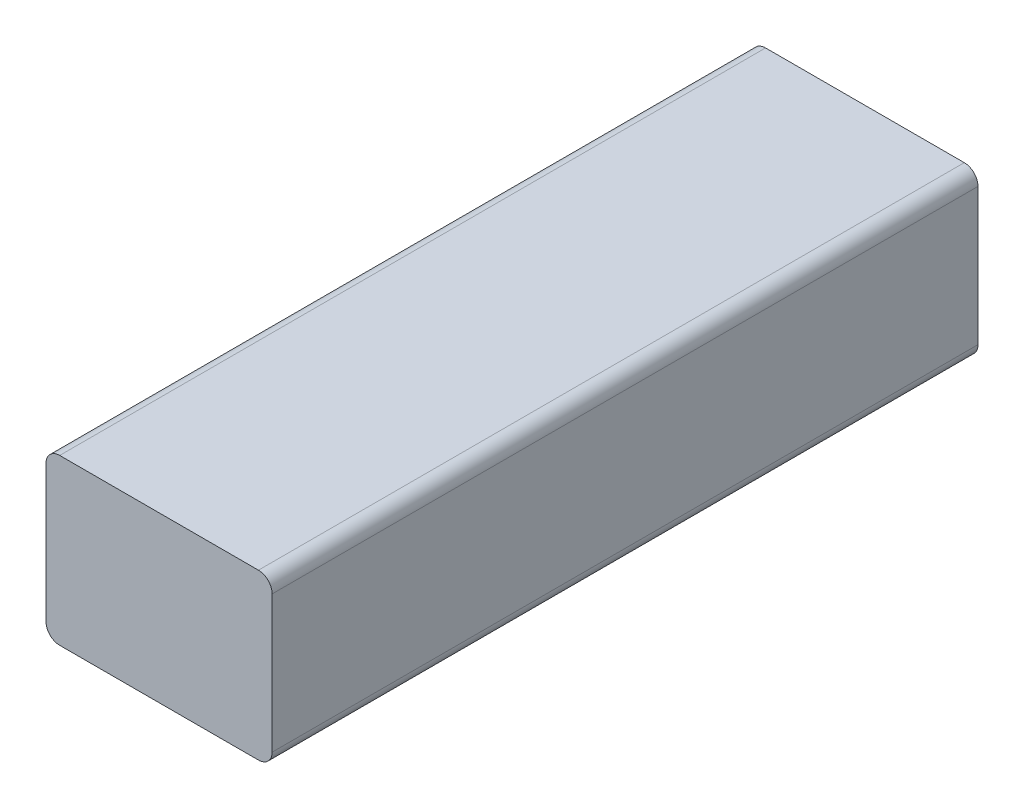
ISO-10303-21;
HEADER;
FILE_DESCRIPTION(('STEP AP214'),'2;1');
FILE_NAME('part.step','',(''),(''),'','','');
FILE_SCHEMA(('AUTOMOTIVE_DESIGN { 1 0 10303 214 1 1 1 1 }'));
ENDSEC;
DATA;
#1=APPLICATION_CONTEXT('core data for automotive mechanical design processes');
#2=APPLICATION_PROTOCOL_DEFINITION('international standard','automotive_design',2000,#1);
#3=PRODUCT_CONTEXT('',#1,'mechanical');
#4=PRODUCT('Part','Part','',(#3));
#5=PRODUCT_RELATED_PRODUCT_CATEGORY('part','',(#4));
#6=PRODUCT_DEFINITION_FORMATION('','',#4);
#7=PRODUCT_DEFINITION_CONTEXT('part definition',#1,'design');
#8=PRODUCT_DEFINITION('design','',#6,#7);
#9=PRODUCT_DEFINITION_SHAPE('','',#8);
#10=(LENGTH_UNIT() NAMED_UNIT(*) SI_UNIT(.MILLI.,.METRE.));
#11=(NAMED_UNIT(*) PLANE_ANGLE_UNIT() SI_UNIT($,.RADIAN.));
#12=(NAMED_UNIT(*) SI_UNIT($,.STERADIAN.) SOLID_ANGLE_UNIT());
#13=UNCERTAINTY_MEASURE_WITH_UNIT(LENGTH_MEASURE(1.E-05),#10,'distance_accuracy_value','');
#14=(GEOMETRIC_REPRESENTATION_CONTEXT(3) GLOBAL_UNCERTAINTY_ASSIGNED_CONTEXT((#13)) GLOBAL_UNIT_ASSIGNED_CONTEXT((#10,
#11,#12)) REPRESENTATION_CONTEXT('',''));
#15=CARTESIAN_POINT('',(0.,0.,0.));
#16=DIRECTION('',(0.,0.,1.));
#17=DIRECTION('',(1.,0.,0.));
#18=AXIS2_PLACEMENT_3D('',#15,#16,#17);
#19=CARTESIAN_POINT('',(-14.5,22.,-51.5));
#20=DIRECTION('',(0.,0.,1.));
#21=DIRECTION('',(1.,0.,0.));
#22=AXIS2_PLACEMENT_3D('',#19,#20,#21);
#23=CYLINDRICAL_SURFACE('',#22,2.);
#24=DIRECTION('',(0.,0.,1.));
#25=VECTOR('',#24,1.);
#26=CARTESIAN_POINT('',(-16.5,22.,0.));
#27=LINE('',#26,#25);
#28=CARTESIAN_POINT('',(-16.5,22.,-51.5));
#29=VERTEX_POINT('',#28);
#30=CARTESIAN_POINT('',(-16.5,22.,51.5));
#31=VERTEX_POINT('',#30);
#32=EDGE_CURVE('E117',#29,#31,#27,.T.);
#33=ORIENTED_EDGE('',*,*,#32,.T.);
#34=CARTESIAN_POINT('',(-14.5,22.,51.5));
#35=DIRECTION('',(0.,0.,1.));
#36=DIRECTION('',(1.,0.,0.));
#37=AXIS2_PLACEMENT_3D('',#34,#35,#36);
#38=CIRCLE('',#37,2.);
#39=CARTESIAN_POINT('',(-14.5,24.,51.5));
#40=VERTEX_POINT('',#39);
#41=EDGE_CURVE('E125',#31,#40,#38,.F.);
#42=ORIENTED_EDGE('',*,*,#41,.T.);
#43=DIRECTION('',(0.,0.,-1.));
#44=VECTOR('',#43,1.);
#45=CARTESIAN_POINT('',(-14.5,24.,0.));
#46=LINE('',#45,#44);
#47=CARTESIAN_POINT('',(-14.5,24.,-51.5));
#48=VERTEX_POINT('',#47);
#49=EDGE_CURVE('E122',#40,#48,#46,.T.);
#50=ORIENTED_EDGE('',*,*,#49,.T.);
#51=CARTESIAN_POINT('',(-14.5,22.,-51.5));
#52=DIRECTION('',(0.,0.,1.));
#53=DIRECTION('',(1.,0.,0.));
#54=AXIS2_PLACEMENT_3D('',#51,#52,#53);
#55=CIRCLE('',#54,2.);
#56=EDGE_CURVE('E113',#48,#29,#55,.T.);
#57=ORIENTED_EDGE('',*,*,#56,.T.);
#58=EDGE_LOOP('',(#33,#42,#50,#57));
#59=FACE_BOUND('',#58,.T.);
#60=ADVANCED_FACE('F17',(#59),#23,.T.);
#61=CARTESIAN_POINT('',(-14.5,24.,51.5));
#62=DIRECTION('',(0.,-1.,0.));
#63=DIRECTION('',(0.,0.,-1.));
#64=AXIS2_PLACEMENT_3D('',#61,#62,#63);
#65=PLANE('',#64);
#66=ORIENTED_EDGE('',*,*,#49,.F.);
#67=DIRECTION('',(1.,0.,0.));
#68=VECTOR('',#67,1.);
#69=CARTESIAN_POINT('',(0.,24.,51.5));
#70=LINE('',#69,#68);
#71=CARTESIAN_POINT('',(14.5000000002051,24.,51.5));
#72=VERTEX_POINT('',#71);
#73=EDGE_CURVE('E134',#40,#72,#70,.T.);
#74=ORIENTED_EDGE('',*,*,#73,.T.);
#75=DIRECTION('',(0.,0.,1.));
#76=VECTOR('',#75,1.);
#77=CARTESIAN_POINT('',(14.5000000004102,24.,0.));
#78=LINE('',#77,#76);
#79=CARTESIAN_POINT('',(14.5000000002051,24.,-51.5));
#80=VERTEX_POINT('',#79);
#81=EDGE_CURVE('E89',#72,#80,#78,.F.);
#82=ORIENTED_EDGE('',*,*,#81,.T.);
#83=DIRECTION('',(-1.,0.,0.));
#84=VECTOR('',#83,1.);
#85=CARTESIAN_POINT('',(0.,24.,-51.5));
#86=LINE('',#85,#84);
#87=EDGE_CURVE('E86',#80,#48,#86,.T.);
#88=ORIENTED_EDGE('',*,*,#87,.T.);
#89=EDGE_LOOP('',(#66,#74,#82,#88));
#90=FACE_BOUND('',#89,.T.);
#91=ADVANCED_FACE('F143',(#90),#65,.F.);
#92=CARTESIAN_POINT('',(-14.5,0.,51.5));
#93=DIRECTION('',(0.,-1.,0.));
#94=DIRECTION('',(0.,0.,-1.));
#95=AXIS2_PLACEMENT_3D('',#92,#93,#94);
#96=PLANE('',#95);
#97=DIRECTION('',(1.,0.,0.));
#98=VECTOR('',#97,1.);
#99=CARTESIAN_POINT('',(0.,0.,-51.5));
#100=LINE('',#99,#98);
#101=CARTESIAN_POINT('',(-14.4999999996153,0.,-51.5));
#102=VERTEX_POINT('',#101);
#103=CARTESIAN_POINT('',(14.4999999996153,0.,-51.5));
#104=VERTEX_POINT('',#103);
#105=EDGE_CURVE('E106',#102,#104,#100,.T.);
#106=ORIENTED_EDGE('',*,*,#105,.T.);
#107=DIRECTION('',(0.,0.,-1.));
#108=VECTOR('',#107,1.);
#109=CARTESIAN_POINT('',(14.4999999992306,0.,0.));
#110=LINE('',#109,#108);
#111=CARTESIAN_POINT('',(14.4999999996153,0.,51.5));
#112=VERTEX_POINT('',#111);
#113=EDGE_CURVE('E123',#104,#112,#110,.F.);
#114=ORIENTED_EDGE('',*,*,#113,.T.);
#115=DIRECTION('',(-1.,0.,0.));
#116=VECTOR('',#115,1.);
#117=CARTESIAN_POINT('',(0.,0.,51.5));
#118=LINE('',#117,#116);
#119=CARTESIAN_POINT('',(-14.4999999996153,0.,51.5));
#120=VERTEX_POINT('',#119);
#121=EDGE_CURVE('E131',#112,#120,#118,.T.);
#122=ORIENTED_EDGE('',*,*,#121,.T.);
#123=DIRECTION('',(0.,0.,1.));
#124=VECTOR('',#123,1.);
#125=CARTESIAN_POINT('',(-14.4999999992306,0.,0.));
#126=LINE('',#125,#124);
#127=EDGE_CURVE('E120',#120,#102,#126,.F.);
#128=ORIENTED_EDGE('',*,*,#127,.T.);
#129=EDGE_LOOP('',(#106,#114,#122,#128));
#130=FACE_BOUND('',#129,.T.);
#131=ADVANCED_FACE('F155',(#130),#96,.T.);
#132=CARTESIAN_POINT('',(-14.5,2.,51.5));
#133=DIRECTION('',(0.,0.,-1.));
#134=DIRECTION('',(-1.,0.,0.));
#135=AXIS2_PLACEMENT_3D('',#132,#133,#134);
#136=CYLINDRICAL_SURFACE('',#135,2.);
#137=ORIENTED_EDGE('',*,*,#127,.F.);
#138=CARTESIAN_POINT('',(-14.5,2.,51.5));
#139=DIRECTION('',(0.,0.,-1.));
#140=DIRECTION('',(-1.,0.,0.));
#141=AXIS2_PLACEMENT_3D('',#138,#139,#140);
#142=CIRCLE('',#141,2.);
#143=CARTESIAN_POINT('',(-16.5,2.,51.5));
#144=VERTEX_POINT('',#143);
#145=EDGE_CURVE('E102',#120,#144,#142,.T.);
#146=ORIENTED_EDGE('',*,*,#145,.T.);
#147=DIRECTION('',(0.,0.,-1.));
#148=VECTOR('',#147,1.);
#149=CARTESIAN_POINT('',(-16.5,2.,0.));
#150=LINE('',#149,#148);
#151=CARTESIAN_POINT('',(-16.5,2.,-51.5));
#152=VERTEX_POINT('',#151);
#153=EDGE_CURVE('E115',#144,#152,#150,.T.);
#154=ORIENTED_EDGE('',*,*,#153,.T.);
#155=CARTESIAN_POINT('',(-14.5,2.,-51.5));
#156=DIRECTION('',(0.,0.,-1.));
#157=DIRECTION('',(-1.,0.,0.));
#158=AXIS2_PLACEMENT_3D('',#155,#156,#157);
#159=CIRCLE('',#158,2.);
#160=EDGE_CURVE('E109',#152,#102,#159,.F.);
#161=ORIENTED_EDGE('',*,*,#160,.T.);
#162=EDGE_LOOP('',(#137,#146,#154,#161));
#163=FACE_BOUND('',#162,.T.);
#164=ADVANCED_FACE('F160',(#163),#136,.T.);
#165=CARTESIAN_POINT('',(-16.5,2.,51.5));
#166=DIRECTION('',(1.,0.,0.));
#167=DIRECTION('',(0.,0.,-1.));
#168=AXIS2_PLACEMENT_3D('',#165,#166,#167);
#169=PLANE('',#168);
#170=ORIENTED_EDGE('',*,*,#153,.F.);
#171=DIRECTION('',(0.,1.,0.));
#172=VECTOR('',#171,1.);
#173=CARTESIAN_POINT('',(-16.5,12.,51.5));
#174=LINE('',#173,#172);
#175=EDGE_CURVE('E99',#144,#31,#174,.T.);
#176=ORIENTED_EDGE('',*,*,#175,.T.);
#177=ORIENTED_EDGE('',*,*,#32,.F.);
#178=DIRECTION('',(0.,-1.,0.));
#179=VECTOR('',#178,1.);
#180=CARTESIAN_POINT('',(-16.5,12.,-51.5));
#181=LINE('',#180,#179);
#182=EDGE_CURVE('E110',#29,#152,#181,.T.);
#183=ORIENTED_EDGE('',*,*,#182,.T.);
#184=EDGE_LOOP('',(#170,#176,#177,#183));
#185=FACE_BOUND('',#184,.T.);
#186=ADVANCED_FACE('F163',(#185),#169,.F.);
#187=CARTESIAN_POINT('',(14.5,22.,51.5));
#188=DIRECTION('',(0.,0.,-1.));
#189=DIRECTION('',(-1.,0.,0.));
#190=AXIS2_PLACEMENT_3D('',#187,#188,#189);
#191=CYLINDRICAL_SURFACE('',#190,2.);
#192=DIRECTION('',(0.,0.,-1.));
#193=VECTOR('',#192,1.);
#194=CARTESIAN_POINT('',(16.5,22.,0.));
#195=LINE('',#194,#193);
#196=CARTESIAN_POINT('',(16.5,22.,51.5));
#197=VERTEX_POINT('',#196);
#198=CARTESIAN_POINT('',(16.5,22.,-51.5));
#199=VERTEX_POINT('',#198);
#200=EDGE_CURVE('E92',#197,#199,#195,.T.);
#201=ORIENTED_EDGE('',*,*,#200,.T.);
#202=CARTESIAN_POINT('',(14.5,22.,-51.5));
#203=DIRECTION('',(0.,0.,-1.));
#204=DIRECTION('',(-1.,0.,0.));
#205=AXIS2_PLACEMENT_3D('',#202,#203,#204);
#206=CIRCLE('',#205,2.);
#207=EDGE_CURVE('E21',#199,#80,#206,.F.);
#208=ORIENTED_EDGE('',*,*,#207,.T.);
#209=ORIENTED_EDGE('',*,*,#81,.F.);
#210=CARTESIAN_POINT('',(14.5,22.,51.5));
#211=DIRECTION('',(0.,0.,-1.));
#212=DIRECTION('',(-1.,0.,0.));
#213=AXIS2_PLACEMENT_3D('',#210,#211,#212);
#214=CIRCLE('',#213,2.);
#215=EDGE_CURVE('E98',#72,#197,#214,.T.);
#216=ORIENTED_EDGE('',*,*,#215,.T.);
#217=EDGE_LOOP('',(#201,#208,#209,#216));
#218=FACE_BOUND('',#217,.T.);
#219=ADVANCED_FACE('F96',(#218),#191,.T.);
#220=CARTESIAN_POINT('',(-16.5,0.,-51.5));
#221=DIRECTION('',(0.,0.,1.));
#222=DIRECTION('',(1.,0.,0.));
#223=AXIS2_PLACEMENT_3D('',#220,#221,#222);
#224=PLANE('',#223);
#225=ORIENTED_EDGE('',*,*,#160,.F.);
#226=ORIENTED_EDGE('',*,*,#182,.F.);
#227=ORIENTED_EDGE('',*,*,#56,.F.);
#228=ORIENTED_EDGE('',*,*,#87,.F.);
#229=ORIENTED_EDGE('',*,*,#207,.F.);
#230=DIRECTION('',(0.,-1.,0.));
#231=VECTOR('',#230,1.);
#232=CARTESIAN_POINT('',(16.5,12.,-51.5));
#233=LINE('',#232,#231);
#234=CARTESIAN_POINT('',(16.5,2.,-51.5));
#235=VERTEX_POINT('',#234);
#236=EDGE_CURVE('E83',#199,#235,#233,.T.);
#237=ORIENTED_EDGE('',*,*,#236,.T.);
#238=CARTESIAN_POINT('',(14.5,2.,-51.5));
#239=DIRECTION('',(0.,0.,1.));
#240=DIRECTION('',(1.,0.,0.));
#241=AXIS2_PLACEMENT_3D('',#238,#239,#240);
#242=CIRCLE('',#241,2.);
#243=EDGE_CURVE('E108',#235,#104,#242,.F.);
#244=ORIENTED_EDGE('',*,*,#243,.T.);
#245=ORIENTED_EDGE('',*,*,#105,.F.);
#246=EDGE_LOOP('',(#225,#226,#227,#228,#229,#237,#244,#245));
#247=FACE_BOUND('',#246,.T.);
#248=ADVANCED_FACE('F81',(#247),#224,.F.);
#249=CARTESIAN_POINT('',(14.5,2.,-51.5));
#250=DIRECTION('',(0.,0.,1.));
#251=DIRECTION('',(1.,0.,0.));
#252=AXIS2_PLACEMENT_3D('',#249,#250,#251);
#253=CYLINDRICAL_SURFACE('',#252,2.);
#254=ORIENTED_EDGE('',*,*,#113,.F.);
#255=ORIENTED_EDGE('',*,*,#243,.F.);
#256=DIRECTION('',(0.,0.,1.));
#257=VECTOR('',#256,1.);
#258=CARTESIAN_POINT('',(16.5,2.,0.));
#259=LINE('',#258,#257);
#260=CARTESIAN_POINT('',(16.5,2.,51.5));
#261=VERTEX_POINT('',#260);
#262=EDGE_CURVE('E27',#235,#261,#259,.T.);
#263=ORIENTED_EDGE('',*,*,#262,.T.);
#264=CARTESIAN_POINT('',(14.5,2.,51.5));
#265=DIRECTION('',(0.,0.,1.));
#266=DIRECTION('',(1.,0.,0.));
#267=AXIS2_PLACEMENT_3D('',#264,#265,#266);
#268=CIRCLE('',#267,2.);
#269=EDGE_CURVE('E35',#261,#112,#268,.F.);
#270=ORIENTED_EDGE('',*,*,#269,.T.);
#271=EDGE_LOOP('',(#254,#255,#263,#270));
#272=FACE_BOUND('',#271,.T.);
#273=ADVANCED_FACE('F150',(#272),#253,.T.);
#274=CARTESIAN_POINT('',(16.5,0.,51.5));
#275=DIRECTION('',(0.,0.,-1.));
#276=DIRECTION('',(-1.,0.,0.));
#277=AXIS2_PLACEMENT_3D('',#274,#275,#276);
#278=PLANE('',#277);
#279=ORIENTED_EDGE('',*,*,#145,.F.);
#280=ORIENTED_EDGE('',*,*,#121,.F.);
#281=ORIENTED_EDGE('',*,*,#269,.F.);
#282=DIRECTION('',(0.,1.,0.));
#283=VECTOR('',#282,1.);
#284=CARTESIAN_POINT('',(16.5,12.,51.5));
#285=LINE('',#284,#283);
#286=EDGE_CURVE('E11',#261,#197,#285,.T.);
#287=ORIENTED_EDGE('',*,*,#286,.T.);
#288=ORIENTED_EDGE('',*,*,#215,.F.);
#289=ORIENTED_EDGE('',*,*,#73,.F.);
#290=ORIENTED_EDGE('',*,*,#41,.F.);
#291=ORIENTED_EDGE('',*,*,#175,.F.);
#292=EDGE_LOOP('',(#279,#280,#281,#287,#288,#289,#290,#291));
#293=FACE_BOUND('',#292,.T.);
#294=ADVANCED_FACE('F147',(#293),#278,.F.);
#295=CARTESIAN_POINT('',(16.5,2.,-51.5));
#296=DIRECTION('',(-1.,0.,0.));
#297=DIRECTION('',(0.,0.,1.));
#298=AXIS2_PLACEMENT_3D('',#295,#296,#297);
#299=PLANE('',#298);
#300=ORIENTED_EDGE('',*,*,#262,.F.);
#301=ORIENTED_EDGE('',*,*,#236,.F.);
#302=ORIENTED_EDGE('',*,*,#200,.F.);
#303=ORIENTED_EDGE('',*,*,#286,.F.);
#304=EDGE_LOOP('',(#300,#301,#302,#303));
#305=FACE_BOUND('',#304,.T.);
#306=ADVANCED_FACE('F19',(#305),#299,.F.);
#307=CLOSED_SHELL('',(#60,#91,#131,#164,#186,#219,#248,#273,#294,#306));
#308=MANIFOLD_SOLID_BREP('B1',#307);
#309=ADVANCED_BREP_SHAPE_REPRESENTATION('',(#18,#308),#14);
#310=SHAPE_DEFINITION_REPRESENTATION(#9,#309);
ENDSEC;
END-ISO-10303-21;
